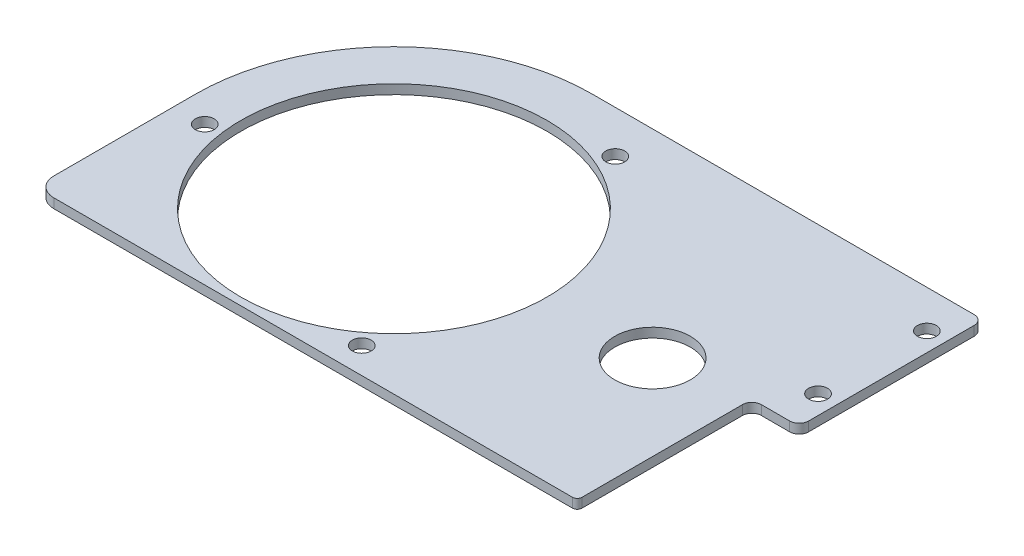
ISO-10303-21;
HEADER;
FILE_DESCRIPTION(('STEP AP214'),'2;1');
FILE_NAME('part.step','',(''),(''),'','','');
FILE_SCHEMA(('AUTOMOTIVE_DESIGN { 1 0 10303 214 1 1 1 1 }'));
ENDSEC;
DATA;
#1=APPLICATION_CONTEXT('core data for automotive mechanical design processes');
#2=APPLICATION_PROTOCOL_DEFINITION('international standard','automotive_design',2000,#1);
#3=PRODUCT_CONTEXT('',#1,'mechanical');
#4=PRODUCT('Part','Part','',(#3));
#5=PRODUCT_RELATED_PRODUCT_CATEGORY('part','',(#4));
#6=PRODUCT_DEFINITION_FORMATION('','',#4);
#7=PRODUCT_DEFINITION_CONTEXT('part definition',#1,'design');
#8=PRODUCT_DEFINITION('design','',#6,#7);
#9=PRODUCT_DEFINITION_SHAPE('','',#8);
#10=(LENGTH_UNIT() NAMED_UNIT(*) SI_UNIT(.MILLI.,.METRE.));
#11=(NAMED_UNIT(*) PLANE_ANGLE_UNIT() SI_UNIT($,.RADIAN.));
#12=(NAMED_UNIT(*) SI_UNIT($,.STERADIAN.) SOLID_ANGLE_UNIT());
#13=UNCERTAINTY_MEASURE_WITH_UNIT(LENGTH_MEASURE(1.E-05),#10,'distance_accuracy_value','');
#14=(GEOMETRIC_REPRESENTATION_CONTEXT(3) GLOBAL_UNCERTAINTY_ASSIGNED_CONTEXT((#13)) GLOBAL_UNIT_ASSIGNED_CONTEXT((#10,
#11,#12)) REPRESENTATION_CONTEXT('',''));
#15=CARTESIAN_POINT('',(0.,0.,0.));
#16=DIRECTION('',(0.,0.,1.));
#17=DIRECTION('',(1.,0.,0.));
#18=AXIS2_PLACEMENT_3D('',#15,#16,#17);
#19=CARTESIAN_POINT('',(-120.668920929197,6.35,95.2310790708027));
#20=DIRECTION('',(0.,-1.,0.));
#21=DIRECTION('',(0.,0.,-1.));
#22=AXIS2_PLACEMENT_3D('',#19,#20,#21);
#23=PLANE('',#22);
#24=CARTESIAN_POINT('',(-120.668920929197,6.35,95.2310790708027));
#25=DIRECTION('',(0.,1.,0.));
#26=DIRECTION('',(0.,0.,-1.));
#27=AXIS2_PLACEMENT_3D('',#24,#25,#26);
#28=CIRCLE('',#27,12.7);
#29=CARTESIAN_POINT('',(-133.368920929197,6.35,95.2310790708027));
#30=VERTEX_POINT('',#29);
#31=CARTESIAN_POINT('',(-120.668920929197,6.35,107.931079070803));
#32=VERTEX_POINT('',#31);
#33=EDGE_CURVE('E178',#30,#32,#28,.T.);
#34=ORIENTED_EDGE('',*,*,#33,.T.);
#35=DIRECTION('',(1.,0.,0.));
#36=VECTOR('',#35,1.);
#37=CARTESIAN_POINT('',(227.955539535401,6.35,107.931079070803));
#38=LINE('',#37,#36);
#39=CARTESIAN_POINT('',(227.955539535401,6.35,107.931079070803));
#40=VERTEX_POINT('',#39);
#41=EDGE_CURVE('E106',#32,#40,#38,.T.);
#42=ORIENTED_EDGE('',*,*,#41,.T.);
#43=CARTESIAN_POINT('',(227.955539535401,6.35,104.765539535401));
#44=DIRECTION('',(0.,1.,0.));
#45=DIRECTION('',(0.,0.,1.));
#46=AXIS2_PLACEMENT_3D('',#43,#44,#45);
#47=CIRCLE('',#46,3.16553953540139);
#48=CARTESIAN_POINT('',(231.121079070803,6.35,104.765539535401));
#49=VERTEX_POINT('',#48);
#50=EDGE_CURVE('E205',#40,#49,#47,.T.);
#51=ORIENTED_EDGE('',*,*,#50,.T.);
#52=DIRECTION('',(0.,0.,-1.));
#53=VECTOR('',#52,1.);
#54=CARTESIAN_POINT('',(231.121079070803,6.35,104.765539535401));
#55=LINE('',#54,#53);
#56=CARTESIAN_POINT('',(231.121079070803,6.35,-3.1007771089668));
#57=VERTEX_POINT('',#56);
#58=EDGE_CURVE('E224',#49,#57,#55,.T.);
#59=ORIENTED_EDGE('',*,*,#58,.T.);
#60=CARTESIAN_POINT('',(237.471079070803,6.35,-3.1007771089668));
#61=DIRECTION('',(0.,-1.,0.));
#62=DIRECTION('',(0.,0.,1.));
#63=AXIS2_PLACEMENT_3D('',#60,#61,#62);
#64=CIRCLE('',#63,6.35);
#65=CARTESIAN_POINT('',(237.471079070803,6.35,-9.4507771089668));
#66=VERTEX_POINT('',#65);
#67=EDGE_CURVE('E221',#57,#66,#64,.T.);
#68=ORIENTED_EDGE('',*,*,#67,.T.);
#69=DIRECTION('',(1.,0.,0.));
#70=VECTOR('',#69,1.);
#71=CARTESIAN_POINT('',(237.471079070803,6.35,-9.4507771089668));
#72=LINE('',#71,#70);
#73=CARTESIAN_POINT('',(256.521079070803,6.35,-9.4507771089668));
#74=VERTEX_POINT('',#73);
#75=EDGE_CURVE('E223',#66,#74,#72,.T.);
#76=ORIENTED_EDGE('',*,*,#75,.T.);
#77=CARTESIAN_POINT('',(256.521079070803,6.35,-15.8007771089668));
#78=DIRECTION('',(0.,1.,0.));
#79=DIRECTION('',(0.,0.,-1.));
#80=AXIS2_PLACEMENT_3D('',#77,#78,#79);
#81=CIRCLE('',#80,6.35000000000001);
#82=CARTESIAN_POINT('',(262.871079070803,6.35,-15.8007771089668));
#83=VERTEX_POINT('',#82);
#84=EDGE_CURVE('E226',#74,#83,#81,.T.);
#85=ORIENTED_EDGE('',*,*,#84,.T.);
#86=DIRECTION('',(0.,0.,-1.));
#87=VECTOR('',#86,1.);
#88=CARTESIAN_POINT('',(262.871079070803,6.35,-127.018920929198));
#89=LINE('',#88,#87);
#90=CARTESIAN_POINT('',(262.871079070803,6.35,-127.018920929198));
#91=VERTEX_POINT('',#90);
#92=EDGE_CURVE('E232',#83,#91,#89,.T.);
#93=ORIENTED_EDGE('',*,*,#92,.T.);
#94=CARTESIAN_POINT('',(256.521079070803,6.35,-127.018920929198));
#95=DIRECTION('',(0.,1.,0.));
#96=DIRECTION('',(0.,0.,-1.));
#97=AXIS2_PLACEMENT_3D('',#94,#95,#96);
#98=CIRCLE('',#97,6.34999999999997);
#99=CARTESIAN_POINT('',(256.521079070803,6.35,-133.368920929197));
#100=VERTEX_POINT('',#99);
#101=EDGE_CURVE('E137',#91,#100,#98,.T.);
#102=ORIENTED_EDGE('',*,*,#101,.T.);
#103=DIRECTION('',(-1.,0.,0.));
#104=VECTOR('',#103,1.);
#105=CARTESIAN_POINT('',(256.521079070803,6.35,-133.368920929197));
#106=LINE('',#105,#104);
#107=CARTESIAN_POINT('',(0.,6.35,-133.368920929197));
#108=VERTEX_POINT('',#107);
#109=EDGE_CURVE('E131',#100,#108,#106,.T.);
#110=ORIENTED_EDGE('',*,*,#109,.T.);
#111=CARTESIAN_POINT('',(0.,6.35,0.));
#112=DIRECTION('',(0.,1.,0.));
#113=DIRECTION('',(0.,0.,-1.));
#114=AXIS2_PLACEMENT_3D('',#111,#112,#113);
#115=CIRCLE('',#114,133.368920929197);
#116=CARTESIAN_POINT('',(-133.368920929197,6.35,0.));
#117=VERTEX_POINT('',#116);
#118=EDGE_CURVE('E135',#108,#117,#115,.T.);
#119=ORIENTED_EDGE('',*,*,#118,.T.);
#120=DIRECTION('',(0.,0.,1.));
#121=VECTOR('',#120,1.);
#122=CARTESIAN_POINT('',(-133.368920929197,6.35,0.));
#123=LINE('',#122,#121);
#124=EDGE_CURVE('E51',#117,#30,#123,.T.);
#125=ORIENTED_EDGE('',*,*,#124,.T.);
#126=EDGE_LOOP('',(#34,#42,#51,#59,#68,#76,#85,#93,#102,#110,#119,#125));
#127=FACE_BOUND('',#126,.T.);
#128=CARTESIAN_POINT('',(0.,6.35,0.));
#129=DIRECTION('',(0.,1.,0.));
#130=DIRECTION('',(0.,0.,1.));
#131=AXIS2_PLACEMENT_3D('',#128,#129,#130);
#132=CIRCLE('',#131,102.87);
#133=CARTESIAN_POINT('',(0.,6.35,102.87));
#134=VERTEX_POINT('',#133);
#135=EDGE_CURVE('E159',#134,#134,#132,.T.);
#136=ORIENTED_EDGE('',*,*,#135,.F.);
#137=EDGE_LOOP('',(#136));
#138=FACE_BOUND('',#137,.T.);
#139=CARTESIAN_POINT('',(-112.738641363337,6.35,14.3749635436912));
#140=DIRECTION('',(0.,1.,0.));
#141=DIRECTION('',(0.,0.,1.));
#142=AXIS2_PLACEMENT_3D('',#139,#140,#141);
#143=CIRCLE('',#142,6.34999999998862);
#144=CARTESIAN_POINT('',(-112.738641363337,6.35,20.7249635436798));
#145=VERTEX_POINT('',#144);
#146=EDGE_CURVE('E326',#145,#145,#143,.T.);
#147=ORIENTED_EDGE('',*,*,#146,.F.);
#148=EDGE_LOOP('',(#147));
#149=FACE_BOUND('',#148,.T.);
#150=CARTESIAN_POINT('',(250.171079070803,6.35,-107.968920929197));
#151=DIRECTION('',(0.,1.,0.));
#152=DIRECTION('',(0.,0.,1.));
#153=AXIS2_PLACEMENT_3D('',#150,#151,#152);
#154=CIRCLE('',#153,6.34999999999999);
#155=CARTESIAN_POINT('',(250.171079070803,6.35,-101.618920929198));
#156=VERTEX_POINT('',#155);
#157=EDGE_CURVE('E320',#156,#156,#154,.T.);
#158=ORIENTED_EDGE('',*,*,#157,.F.);
#159=EDGE_LOOP('',(#158));
#160=FACE_BOUND('',#159,.T.);
#161=CARTESIAN_POINT('',(250.171079070803,6.35,-34.8507771089668));
#162=DIRECTION('',(0.,1.,0.));
#163=DIRECTION('',(0.,0.,1.));
#164=AXIS2_PLACEMENT_3D('',#161,#162,#163);
#165=CIRCLE('',#164,6.34999999999993);
#166=CARTESIAN_POINT('',(250.171079070803,6.35,-28.5007771089669));
#167=VERTEX_POINT('',#166);
#168=EDGE_CURVE('E314',#167,#167,#165,.T.);
#169=ORIENTED_EDGE('',*,*,#168,.F.);
#170=EDGE_LOOP('',(#169));
#171=FACE_BOUND('',#170,.T.);
#172=CARTESIAN_POINT('',(43.9202370743566,6.35,-104.822009180638));
#173=DIRECTION('',(0.,1.,0.));
#174=DIRECTION('',(0.,0.,1.));
#175=AXIS2_PLACEMENT_3D('',#172,#173,#174);
#176=CIRCLE('',#175,6.35000000000598);
#177=CARTESIAN_POINT('',(43.9202370743566,6.35,-98.4720091806325));
#178=VERTEX_POINT('',#177);
#179=EDGE_CURVE('E308',#178,#178,#176,.T.);
#180=ORIENTED_EDGE('',*,*,#179,.F.);
#181=EDGE_LOOP('',(#180));
#182=FACE_BOUND('',#181,.T.);
#183=CARTESIAN_POINT('',(68.8184042889803,6.35,90.4470456369472));
#184=DIRECTION('',(0.,1.,0.));
#185=DIRECTION('',(0.,0.,1.));
#186=AXIS2_PLACEMENT_3D('',#183,#184,#185);
#187=CIRCLE('',#186,6.35000000000536);
#188=CARTESIAN_POINT('',(68.8184042889803,6.35,96.7970456369525));
#189=VERTEX_POINT('',#188);
#190=EDGE_CURVE('E301',#189,#189,#187,.T.);
#191=ORIENTED_EDGE('',*,*,#190,.F.);
#192=EDGE_LOOP('',(#191));
#193=FACE_BOUND('',#192,.T.);
#194=CARTESIAN_POINT('',(173.810939205606,6.35,0.));
#195=DIRECTION('',(0.,-1.,0.));
#196=DIRECTION('',(0.,0.,-1.));
#197=AXIS2_PLACEMENT_3D('',#194,#195,#196);
#198=CIRCLE('',#197,25.4);
#199=CARTESIAN_POINT('',(173.810939205606,6.35,-25.4));
#200=VERTEX_POINT('',#199);
#201=EDGE_CURVE('E296',#200,#200,#198,.F.);
#202=ORIENTED_EDGE('',*,*,#201,.F.);
#203=EDGE_LOOP('',(#202));
#204=FACE_BOUND('',#203,.T.);
#205=ADVANCED_FACE('F34',(#127,#138,#149,#160,#171,#182,#193,#204),#23,.F.);
#206=CARTESIAN_POINT('',(-120.668920929197,0.,95.2310790708027));
#207=DIRECTION('',(0.,-1.,0.));
#208=DIRECTION('',(0.,0.,-1.));
#209=AXIS2_PLACEMENT_3D('',#206,#207,#208);
#210=PLANE('',#209);
#211=CARTESIAN_POINT('',(68.8184042889803,0.,90.4470456369472));
#212=DIRECTION('',(0.,1.,0.));
#213=DIRECTION('',(0.,0.,1.));
#214=AXIS2_PLACEMENT_3D('',#211,#212,#213);
#215=CIRCLE('',#214,6.35000000000536);
#216=CARTESIAN_POINT('',(68.8184042889803,0.,96.7970456369525));
#217=VERTEX_POINT('',#216);
#218=EDGE_CURVE('E298',#217,#217,#215,.T.);
#219=ORIENTED_EDGE('',*,*,#218,.T.);
#220=EDGE_LOOP('',(#219));
#221=FACE_BOUND('',#220,.T.);
#222=CARTESIAN_POINT('',(250.171079070803,0.,-34.8507771089668));
#223=DIRECTION('',(0.,1.,0.));
#224=DIRECTION('',(0.,0.,1.));
#225=AXIS2_PLACEMENT_3D('',#222,#223,#224);
#226=CIRCLE('',#225,6.34999999999993);
#227=CARTESIAN_POINT('',(250.171079070803,0.,-28.5007771089669));
#228=VERTEX_POINT('',#227);
#229=EDGE_CURVE('E311',#228,#228,#226,.T.);
#230=ORIENTED_EDGE('',*,*,#229,.T.);
#231=EDGE_LOOP('',(#230));
#232=FACE_BOUND('',#231,.T.);
#233=CARTESIAN_POINT('',(-112.738641363337,0.,14.3749635436912));
#234=DIRECTION('',(0.,1.,0.));
#235=DIRECTION('',(0.,0.,1.));
#236=AXIS2_PLACEMENT_3D('',#233,#234,#235);
#237=CIRCLE('',#236,6.34999999998862);
#238=CARTESIAN_POINT('',(-112.738641363337,0.,20.7249635436798));
#239=VERTEX_POINT('',#238);
#240=EDGE_CURVE('E323',#239,#239,#237,.T.);
#241=ORIENTED_EDGE('',*,*,#240,.T.);
#242=EDGE_LOOP('',(#241));
#243=FACE_BOUND('',#242,.T.);
#244=CARTESIAN_POINT('',(-120.668920929197,0.,95.2310790708027));
#245=DIRECTION('',(0.,1.,0.));
#246=DIRECTION('',(0.,0.,-1.));
#247=AXIS2_PLACEMENT_3D('',#244,#245,#246);
#248=CIRCLE('',#247,12.7);
#249=CARTESIAN_POINT('',(-133.368920929197,0.,95.2310790708027));
#250=VERTEX_POINT('',#249);
#251=CARTESIAN_POINT('',(-120.668920929197,0.,107.931079070803));
#252=VERTEX_POINT('',#251);
#253=EDGE_CURVE('E155',#250,#252,#248,.T.);
#254=ORIENTED_EDGE('',*,*,#253,.F.);
#255=DIRECTION('',(0.,0.,1.));
#256=VECTOR('',#255,1.);
#257=CARTESIAN_POINT('',(-133.368920929197,0.,0.));
#258=LINE('',#257,#256);
#259=CARTESIAN_POINT('',(-133.368920929197,0.,0.));
#260=VERTEX_POINT('',#259);
#261=EDGE_CURVE('E98',#260,#250,#258,.T.);
#262=ORIENTED_EDGE('',*,*,#261,.F.);
#263=CARTESIAN_POINT('',(0.,0.,0.));
#264=DIRECTION('',(0.,1.,0.));
#265=DIRECTION('',(0.,0.,-1.));
#266=AXIS2_PLACEMENT_3D('',#263,#264,#265);
#267=CIRCLE('',#266,133.368920929197);
#268=CARTESIAN_POINT('',(0.,0.,-133.368920929197));
#269=VERTEX_POINT('',#268);
#270=EDGE_CURVE('E92',#269,#260,#267,.T.);
#271=ORIENTED_EDGE('',*,*,#270,.F.);
#272=DIRECTION('',(-1.,0.,0.));
#273=VECTOR('',#272,1.);
#274=CARTESIAN_POINT('',(256.521079070803,0.,-133.368920929197));
#275=LINE('',#274,#273);
#276=CARTESIAN_POINT('',(256.521079070803,0.,-133.368920929197));
#277=VERTEX_POINT('',#276);
#278=EDGE_CURVE('E145',#277,#269,#275,.T.);
#279=ORIENTED_EDGE('',*,*,#278,.F.);
#280=CARTESIAN_POINT('',(256.521079070803,0.,-127.018920929198));
#281=DIRECTION('',(0.,1.,0.));
#282=DIRECTION('',(0.,0.,-1.));
#283=AXIS2_PLACEMENT_3D('',#280,#281,#282);
#284=CIRCLE('',#283,6.34999999999997);
#285=CARTESIAN_POINT('',(262.871079070803,0.,-127.018920929198));
#286=VERTEX_POINT('',#285);
#287=EDGE_CURVE('E173',#286,#277,#284,.T.);
#288=ORIENTED_EDGE('',*,*,#287,.F.);
#289=DIRECTION('',(0.,0.,-1.));
#290=VECTOR('',#289,1.);
#291=CARTESIAN_POINT('',(262.871079070803,0.,-127.018920929198));
#292=LINE('',#291,#290);
#293=CARTESIAN_POINT('',(262.871079070803,0.,-15.8007771089668));
#294=VERTEX_POINT('',#293);
#295=EDGE_CURVE('E171',#294,#286,#292,.T.);
#296=ORIENTED_EDGE('',*,*,#295,.F.);
#297=CARTESIAN_POINT('',(256.521079070803,0.,-15.8007771089668));
#298=DIRECTION('',(0.,1.,0.));
#299=DIRECTION('',(0.,0.,-1.));
#300=AXIS2_PLACEMENT_3D('',#297,#298,#299);
#301=CIRCLE('',#300,6.35000000000001);
#302=CARTESIAN_POINT('',(256.521079070803,0.,-9.4507771089668));
#303=VERTEX_POINT('',#302);
#304=EDGE_CURVE('E169',#303,#294,#301,.T.);
#305=ORIENTED_EDGE('',*,*,#304,.F.);
#306=DIRECTION('',(1.,0.,0.));
#307=VECTOR('',#306,1.);
#308=CARTESIAN_POINT('',(237.471079070803,0.,-9.4507771089668));
#309=LINE('',#308,#307);
#310=CARTESIAN_POINT('',(237.471079070803,0.,-9.4507771089668));
#311=VERTEX_POINT('',#310);
#312=EDGE_CURVE('E167',#311,#303,#309,.T.);
#313=ORIENTED_EDGE('',*,*,#312,.F.);
#314=CARTESIAN_POINT('',(237.471079070803,0.,-3.1007771089668));
#315=DIRECTION('',(0.,-1.,0.));
#316=DIRECTION('',(0.,0.,1.));
#317=AXIS2_PLACEMENT_3D('',#314,#315,#316);
#318=CIRCLE('',#317,6.35);
#319=CARTESIAN_POINT('',(231.121079070803,0.,-3.1007771089668));
#320=VERTEX_POINT('',#319);
#321=EDGE_CURVE('E165',#320,#311,#318,.T.);
#322=ORIENTED_EDGE('',*,*,#321,.F.);
#323=DIRECTION('',(0.,0.,-1.));
#324=VECTOR('',#323,1.);
#325=CARTESIAN_POINT('',(231.121079070803,0.,104.765539535401));
#326=LINE('',#325,#324);
#327=CARTESIAN_POINT('',(231.121079070803,0.,104.765539535401));
#328=VERTEX_POINT('',#327);
#329=EDGE_CURVE('E163',#328,#320,#326,.T.);
#330=ORIENTED_EDGE('',*,*,#329,.F.);
#331=CARTESIAN_POINT('',(227.955539535401,0.,104.765539535401));
#332=DIRECTION('',(0.,1.,0.));
#333=DIRECTION('',(0.,0.,1.));
#334=AXIS2_PLACEMENT_3D('',#331,#332,#333);
#335=CIRCLE('',#334,3.16553953540139);
#336=CARTESIAN_POINT('',(227.955539535401,0.,107.931079070803));
#337=VERTEX_POINT('',#336);
#338=EDGE_CURVE('E161',#337,#328,#335,.T.);
#339=ORIENTED_EDGE('',*,*,#338,.F.);
#340=DIRECTION('',(1.,0.,0.));
#341=VECTOR('',#340,1.);
#342=CARTESIAN_POINT('',(227.955539535401,0.,107.931079070803));
#343=LINE('',#342,#341);
#344=EDGE_CURVE('E158',#252,#337,#343,.T.);
#345=ORIENTED_EDGE('',*,*,#344,.F.);
#346=EDGE_LOOP('',(#254,#262,#271,#279,#288,#296,#305,#313,#322,#330,#339,#345));
#347=FACE_BOUND('',#346,.T.);
#348=CARTESIAN_POINT('',(0.,0.,0.));
#349=DIRECTION('',(0.,1.,0.));
#350=DIRECTION('',(0.,0.,1.));
#351=AXIS2_PLACEMENT_3D('',#348,#349,#350);
#352=CIRCLE('',#351,102.87);
#353=CARTESIAN_POINT('',(0.,0.,102.87));
#354=VERTEX_POINT('',#353);
#355=EDGE_CURVE('E329',#354,#354,#352,.T.);
#356=ORIENTED_EDGE('',*,*,#355,.T.);
#357=EDGE_LOOP('',(#356));
#358=FACE_BOUND('',#357,.T.);
#359=CARTESIAN_POINT('',(250.171079070803,0.,-107.968920929197));
#360=DIRECTION('',(0.,1.,0.));
#361=DIRECTION('',(0.,0.,1.));
#362=AXIS2_PLACEMENT_3D('',#359,#360,#361);
#363=CIRCLE('',#362,6.34999999999999);
#364=CARTESIAN_POINT('',(250.171079070803,0.,-101.618920929198));
#365=VERTEX_POINT('',#364);
#366=EDGE_CURVE('E317',#365,#365,#363,.T.);
#367=ORIENTED_EDGE('',*,*,#366,.T.);
#368=EDGE_LOOP('',(#367));
#369=FACE_BOUND('',#368,.T.);
#370=CARTESIAN_POINT('',(43.9202370743566,0.,-104.822009180638));
#371=DIRECTION('',(0.,1.,0.));
#372=DIRECTION('',(0.,0.,1.));
#373=AXIS2_PLACEMENT_3D('',#370,#371,#372);
#374=CIRCLE('',#373,6.35000000000598);
#375=CARTESIAN_POINT('',(43.9202370743566,0.,-98.4720091806325));
#376=VERTEX_POINT('',#375);
#377=EDGE_CURVE('E306',#376,#376,#374,.T.);
#378=ORIENTED_EDGE('',*,*,#377,.T.);
#379=EDGE_LOOP('',(#378));
#380=FACE_BOUND('',#379,.T.);
#381=CARTESIAN_POINT('',(173.810939205606,0.,0.));
#382=DIRECTION('',(0.,1.,0.));
#383=DIRECTION('',(0.,0.,1.));
#384=AXIS2_PLACEMENT_3D('',#381,#382,#383);
#385=CIRCLE('',#384,25.4);
#386=CARTESIAN_POINT('',(173.810939205606,0.,25.4));
#387=VERTEX_POINT('',#386);
#388=EDGE_CURVE('E293',#387,#387,#385,.T.);
#389=ORIENTED_EDGE('',*,*,#388,.T.);
#390=EDGE_LOOP('',(#389));
#391=FACE_BOUND('',#390,.T.);
#392=ADVANCED_FACE('F209',(#221,#232,#243,#347,#358,#369,#380,#391),#210,.T.);
#393=CARTESIAN_POINT('',(-120.668920929197,6.35,95.2310790708027));
#394=DIRECTION('',(0.,-1.,0.));
#395=DIRECTION('',(0.,0.,-1.));
#396=AXIS2_PLACEMENT_3D('',#393,#394,#395);
#397=CYLINDRICAL_SURFACE('',#396,12.7);
#398=ORIENTED_EDGE('',*,*,#253,.T.);
#399=DIRECTION('',(0.,-1.,0.));
#400=VECTOR('',#399,1.);
#401=CARTESIAN_POINT('',(-120.668920929197,6.35,107.931079070803));
#402=LINE('',#401,#400);
#403=EDGE_CURVE('E11',#32,#252,#402,.T.);
#404=ORIENTED_EDGE('',*,*,#403,.F.);
#405=ORIENTED_EDGE('',*,*,#33,.F.);
#406=DIRECTION('',(0.,-1.,0.));
#407=VECTOR('',#406,1.);
#408=CARTESIAN_POINT('',(-133.368920929197,6.35,95.2310790708027));
#409=LINE('',#408,#407);
#410=EDGE_CURVE('E151',#30,#250,#409,.T.);
#411=ORIENTED_EDGE('',*,*,#410,.T.);
#412=EDGE_LOOP('',(#398,#404,#405,#411));
#413=FACE_BOUND('',#412,.T.);
#414=ADVANCED_FACE('F36',(#413),#397,.T.);
#415=CARTESIAN_POINT('',(227.955539535401,6.35,107.931079070803));
#416=DIRECTION('',(0.,0.,-1.));
#417=DIRECTION('',(-1.,0.,0.));
#418=AXIS2_PLACEMENT_3D('',#415,#416,#417);
#419=PLANE('',#418);
#420=ORIENTED_EDGE('',*,*,#344,.T.);
#421=DIRECTION('',(0.,-1.,0.));
#422=VECTOR('',#421,1.);
#423=CARTESIAN_POINT('',(227.955539535401,6.35,107.931079070803));
#424=LINE('',#423,#422);
#425=EDGE_CURVE('E43',#40,#337,#424,.T.);
#426=ORIENTED_EDGE('',*,*,#425,.F.);
#427=ORIENTED_EDGE('',*,*,#41,.F.);
#428=ORIENTED_EDGE('',*,*,#403,.T.);
#429=EDGE_LOOP('',(#420,#426,#427,#428));
#430=FACE_BOUND('',#429,.T.);
#431=ADVANCED_FACE('F470',(#430),#419,.F.);
#432=CARTESIAN_POINT('',(227.955539535401,6.35,104.765539535401));
#433=DIRECTION('',(0.,-1.,0.));
#434=DIRECTION('',(0.,0.,-1.));
#435=AXIS2_PLACEMENT_3D('',#432,#433,#434);
#436=CYLINDRICAL_SURFACE('',#435,3.16553953540139);
#437=ORIENTED_EDGE('',*,*,#338,.T.);
#438=DIRECTION('',(0.,-1.,0.));
#439=VECTOR('',#438,1.);
#440=CARTESIAN_POINT('',(231.121079070803,6.35,104.765539535401));
#441=LINE('',#440,#439);
#442=EDGE_CURVE('E197',#49,#328,#441,.T.);
#443=ORIENTED_EDGE('',*,*,#442,.F.);
#444=ORIENTED_EDGE('',*,*,#50,.F.);
#445=ORIENTED_EDGE('',*,*,#425,.T.);
#446=EDGE_LOOP('',(#437,#443,#444,#445));
#447=FACE_BOUND('',#446,.T.);
#448=ADVANCED_FACE('F203',(#447),#436,.T.);
#449=CARTESIAN_POINT('',(231.121079070803,6.35,104.765539535401));
#450=DIRECTION('',(-1.,0.,0.));
#451=DIRECTION('',(0.,0.,1.));
#452=AXIS2_PLACEMENT_3D('',#449,#450,#451);
#453=PLANE('',#452);
#454=ORIENTED_EDGE('',*,*,#329,.T.);
#455=DIRECTION('',(0.,-1.,0.));
#456=VECTOR('',#455,1.);
#457=CARTESIAN_POINT('',(231.121079070803,6.35,-3.1007771089668));
#458=LINE('',#457,#456);
#459=EDGE_CURVE('E194',#57,#320,#458,.T.);
#460=ORIENTED_EDGE('',*,*,#459,.F.);
#461=ORIENTED_EDGE('',*,*,#58,.F.);
#462=ORIENTED_EDGE('',*,*,#442,.T.);
#463=EDGE_LOOP('',(#454,#460,#461,#462));
#464=FACE_BOUND('',#463,.T.);
#465=ADVANCED_FACE('F215',(#464),#453,.F.);
#466=CARTESIAN_POINT('',(237.471079070803,6.35,-3.1007771089668));
#467=DIRECTION('',(0.,-1.,0.));
#468=DIRECTION('',(0.,0.,-1.));
#469=AXIS2_PLACEMENT_3D('',#466,#467,#468);
#470=CYLINDRICAL_SURFACE('',#469,6.35);
#471=ORIENTED_EDGE('',*,*,#321,.T.);
#472=DIRECTION('',(0.,-1.,0.));
#473=VECTOR('',#472,1.);
#474=CARTESIAN_POINT('',(237.471079070803,6.35,-9.4507771089668));
#475=LINE('',#474,#473);
#476=EDGE_CURVE('E191',#66,#311,#475,.T.);
#477=ORIENTED_EDGE('',*,*,#476,.F.);
#478=ORIENTED_EDGE('',*,*,#67,.F.);
#479=ORIENTED_EDGE('',*,*,#459,.T.);
#480=EDGE_LOOP('',(#471,#477,#478,#479));
#481=FACE_BOUND('',#480,.T.);
#482=ADVANCED_FACE('F219',(#481),#470,.F.);
#483=CARTESIAN_POINT('',(237.471079070803,6.35,-9.4507771089668));
#484=DIRECTION('',(0.,0.,-1.));
#485=DIRECTION('',(-1.,0.,0.));
#486=AXIS2_PLACEMENT_3D('',#483,#484,#485);
#487=PLANE('',#486);
#488=ORIENTED_EDGE('',*,*,#312,.T.);
#489=DIRECTION('',(0.,-1.,0.));
#490=VECTOR('',#489,1.);
#491=CARTESIAN_POINT('',(256.521079070803,6.35,-9.4507771089668));
#492=LINE('',#491,#490);
#493=EDGE_CURVE('E188',#74,#303,#492,.T.);
#494=ORIENTED_EDGE('',*,*,#493,.F.);
#495=ORIENTED_EDGE('',*,*,#75,.F.);
#496=ORIENTED_EDGE('',*,*,#476,.T.);
#497=EDGE_LOOP('',(#488,#494,#495,#496));
#498=FACE_BOUND('',#497,.T.);
#499=ADVANCED_FACE('F435',(#498),#487,.F.);
#500=CARTESIAN_POINT('',(256.521079070803,6.35,-15.8007771089668));
#501=DIRECTION('',(0.,-1.,0.));
#502=DIRECTION('',(0.,0.,-1.));
#503=AXIS2_PLACEMENT_3D('',#500,#501,#502);
#504=CYLINDRICAL_SURFACE('',#503,6.35000000000001);
#505=ORIENTED_EDGE('',*,*,#304,.T.);
#506=DIRECTION('',(0.,-1.,0.));
#507=VECTOR('',#506,1.);
#508=CARTESIAN_POINT('',(262.871079070803,6.35,-15.8007771089668));
#509=LINE('',#508,#507);
#510=EDGE_CURVE('E185',#83,#294,#509,.T.);
#511=ORIENTED_EDGE('',*,*,#510,.F.);
#512=ORIENTED_EDGE('',*,*,#84,.F.);
#513=ORIENTED_EDGE('',*,*,#493,.T.);
#514=EDGE_LOOP('',(#505,#511,#512,#513));
#515=FACE_BOUND('',#514,.T.);
#516=ADVANCED_FACE('F426',(#515),#504,.T.);
#517=CARTESIAN_POINT('',(262.871079070803,6.35,-127.018920929198));
#518=DIRECTION('',(-1.,0.,0.));
#519=DIRECTION('',(0.,0.,1.));
#520=AXIS2_PLACEMENT_3D('',#517,#518,#519);
#521=PLANE('',#520);
#522=ORIENTED_EDGE('',*,*,#295,.T.);
#523=DIRECTION('',(0.,-1.,0.));
#524=VECTOR('',#523,1.);
#525=CARTESIAN_POINT('',(262.871079070803,6.35,-127.018920929198));
#526=LINE('',#525,#524);
#527=EDGE_CURVE('E182',#91,#286,#526,.T.);
#528=ORIENTED_EDGE('',*,*,#527,.F.);
#529=ORIENTED_EDGE('',*,*,#92,.F.);
#530=ORIENTED_EDGE('',*,*,#510,.T.);
#531=EDGE_LOOP('',(#522,#528,#529,#530));
#532=FACE_BOUND('',#531,.T.);
#533=ADVANCED_FACE('F238',(#532),#521,.F.);
#534=CARTESIAN_POINT('',(256.521079070803,6.35,-127.018920929198));
#535=DIRECTION('',(0.,-1.,0.));
#536=DIRECTION('',(0.,0.,-1.));
#537=AXIS2_PLACEMENT_3D('',#534,#535,#536);
#538=CYLINDRICAL_SURFACE('',#537,6.34999999999997);
#539=ORIENTED_EDGE('',*,*,#287,.T.);
#540=DIRECTION('',(0.,-1.,0.));
#541=VECTOR('',#540,1.);
#542=CARTESIAN_POINT('',(256.521079070803,6.35,-133.368920929197));
#543=LINE('',#542,#541);
#544=EDGE_CURVE('E146',#100,#277,#543,.T.);
#545=ORIENTED_EDGE('',*,*,#544,.F.);
#546=ORIENTED_EDGE('',*,*,#101,.F.);
#547=ORIENTED_EDGE('',*,*,#527,.T.);
#548=EDGE_LOOP('',(#539,#545,#546,#547));
#549=FACE_BOUND('',#548,.T.);
#550=ADVANCED_FACE('F242',(#549),#538,.T.);
#551=CARTESIAN_POINT('',(256.521079070803,6.35,-133.368920929197));
#552=DIRECTION('',(0.,0.,1.));
#553=DIRECTION('',(1.,0.,0.));
#554=AXIS2_PLACEMENT_3D('',#551,#552,#553);
#555=PLANE('',#554);
#556=ORIENTED_EDGE('',*,*,#278,.T.);
#557=DIRECTION('',(0.,-1.,0.));
#558=VECTOR('',#557,1.);
#559=CARTESIAN_POINT('',(0.,6.35,-133.368920929197));
#560=LINE('',#559,#558);
#561=EDGE_CURVE('E142',#108,#269,#560,.T.);
#562=ORIENTED_EDGE('',*,*,#561,.F.);
#563=ORIENTED_EDGE('',*,*,#109,.F.);
#564=ORIENTED_EDGE('',*,*,#544,.T.);
#565=EDGE_LOOP('',(#556,#562,#563,#564));
#566=FACE_BOUND('',#565,.T.);
#567=ADVANCED_FACE('F143',(#566),#555,.F.);
#568=CARTESIAN_POINT('',(0.,6.35,0.));
#569=DIRECTION('',(0.,-1.,0.));
#570=DIRECTION('',(0.,0.,-1.));
#571=AXIS2_PLACEMENT_3D('',#568,#569,#570);
#572=CYLINDRICAL_SURFACE('',#571,133.368920929197);
#573=ORIENTED_EDGE('',*,*,#270,.T.);
#574=DIRECTION('',(0.,-1.,0.));
#575=VECTOR('',#574,1.);
#576=CARTESIAN_POINT('',(-133.368920929197,6.35,0.));
#577=LINE('',#576,#575);
#578=EDGE_CURVE('E147',#117,#260,#577,.T.);
#579=ORIENTED_EDGE('',*,*,#578,.F.);
#580=ORIENTED_EDGE('',*,*,#118,.F.);
#581=ORIENTED_EDGE('',*,*,#561,.T.);
#582=EDGE_LOOP('',(#573,#579,#580,#581));
#583=FACE_BOUND('',#582,.T.);
#584=ADVANCED_FACE('F149',(#583),#572,.T.);
#585=CARTESIAN_POINT('',(-133.368920929197,6.35,0.));
#586=DIRECTION('',(1.,0.,0.));
#587=DIRECTION('',(0.,0.,-1.));
#588=AXIS2_PLACEMENT_3D('',#585,#586,#587);
#589=PLANE('',#588);
#590=ORIENTED_EDGE('',*,*,#261,.T.);
#591=ORIENTED_EDGE('',*,*,#410,.F.);
#592=ORIENTED_EDGE('',*,*,#124,.F.);
#593=ORIENTED_EDGE('',*,*,#578,.T.);
#594=EDGE_LOOP('',(#590,#591,#592,#593));
#595=FACE_BOUND('',#594,.T.);
#596=ADVANCED_FACE('F246',(#595),#589,.F.);
#597=CARTESIAN_POINT('',(0.,6.35,0.));
#598=DIRECTION('',(0.,-1.,0.));
#599=DIRECTION('',(0.,0.,-1.));
#600=AXIS2_PLACEMENT_3D('',#597,#598,#599);
#601=CYLINDRICAL_SURFACE('',#600,102.87);
#602=ORIENTED_EDGE('',*,*,#135,.T.);
#603=EDGE_LOOP('',(#602));
#604=FACE_BOUND('',#603,.T.);
#605=ORIENTED_EDGE('',*,*,#355,.F.);
#606=EDGE_LOOP('',(#605));
#607=FACE_BOUND('',#606,.T.);
#608=ADVANCED_FACE('F248',(#604,#607),#601,.F.);
#609=CARTESIAN_POINT('',(-112.738641363337,6.35,14.3749635436912));
#610=DIRECTION('',(0.,-1.,0.));
#611=DIRECTION('',(0.,0.,-1.));
#612=AXIS2_PLACEMENT_3D('',#609,#610,#611);
#613=CYLINDRICAL_SURFACE('',#612,6.34999999998862);
#614=ORIENTED_EDGE('',*,*,#146,.T.);
#615=EDGE_LOOP('',(#614));
#616=FACE_BOUND('',#615,.T.);
#617=ORIENTED_EDGE('',*,*,#240,.F.);
#618=EDGE_LOOP('',(#617));
#619=FACE_BOUND('',#618,.T.);
#620=ADVANCED_FACE('F254',(#616,#619),#613,.F.);
#621=CARTESIAN_POINT('',(250.171079070803,6.35,-107.968920929197));
#622=DIRECTION('',(0.,-1.,0.));
#623=DIRECTION('',(0.,0.,-1.));
#624=AXIS2_PLACEMENT_3D('',#621,#622,#623);
#625=CYLINDRICAL_SURFACE('',#624,6.34999999999999);
#626=ORIENTED_EDGE('',*,*,#157,.T.);
#627=EDGE_LOOP('',(#626));
#628=FACE_BOUND('',#627,.T.);
#629=ORIENTED_EDGE('',*,*,#366,.F.);
#630=EDGE_LOOP('',(#629));
#631=FACE_BOUND('',#630,.T.);
#632=ADVANCED_FACE('F268',(#628,#631),#625,.F.);
#633=CARTESIAN_POINT('',(250.171079070803,6.35,-34.8507771089668));
#634=DIRECTION('',(0.,-1.,0.));
#635=DIRECTION('',(0.,0.,-1.));
#636=AXIS2_PLACEMENT_3D('',#633,#634,#635);
#637=CYLINDRICAL_SURFACE('',#636,6.34999999999993);
#638=ORIENTED_EDGE('',*,*,#168,.T.);
#639=EDGE_LOOP('',(#638));
#640=FACE_BOUND('',#639,.T.);
#641=ORIENTED_EDGE('',*,*,#229,.F.);
#642=EDGE_LOOP('',(#641));
#643=FACE_BOUND('',#642,.T.);
#644=ADVANCED_FACE('F272',(#640,#643),#637,.F.);
#645=CARTESIAN_POINT('',(43.9202370743566,6.35,-104.822009180638));
#646=DIRECTION('',(0.,-1.,0.));
#647=DIRECTION('',(0.,0.,-1.));
#648=AXIS2_PLACEMENT_3D('',#645,#646,#647);
#649=CYLINDRICAL_SURFACE('',#648,6.35000000000598);
#650=ORIENTED_EDGE('',*,*,#179,.T.);
#651=EDGE_LOOP('',(#650));
#652=FACE_BOUND('',#651,.T.);
#653=ORIENTED_EDGE('',*,*,#377,.F.);
#654=EDGE_LOOP('',(#653));
#655=FACE_BOUND('',#654,.T.);
#656=ADVANCED_FACE('F276',(#652,#655),#649,.F.);
#657=CARTESIAN_POINT('',(68.8184042889803,6.35,90.4470456369472));
#658=DIRECTION('',(0.,-1.,0.));
#659=DIRECTION('',(0.,0.,-1.));
#660=AXIS2_PLACEMENT_3D('',#657,#658,#659);
#661=CYLINDRICAL_SURFACE('',#660,6.35000000000536);
#662=ORIENTED_EDGE('',*,*,#190,.T.);
#663=EDGE_LOOP('',(#662));
#664=FACE_BOUND('',#663,.T.);
#665=ORIENTED_EDGE('',*,*,#218,.F.);
#666=EDGE_LOOP('',(#665));
#667=FACE_BOUND('',#666,.T.);
#668=ADVANCED_FACE('F280',(#664,#667),#661,.F.);
#669=CARTESIAN_POINT('',(173.810939205606,28.448,0.));
#670=DIRECTION('',(0.,-1.,0.));
#671=DIRECTION('',(0.,0.,-1.));
#672=AXIS2_PLACEMENT_3D('',#669,#670,#671);
#673=CYLINDRICAL_SURFACE('',#672,25.4);
#674=ORIENTED_EDGE('',*,*,#388,.F.);
#675=EDGE_LOOP('',(#674));
#676=FACE_BOUND('',#675,.T.);
#677=ORIENTED_EDGE('',*,*,#201,.T.);
#678=EDGE_LOOP('',(#677));
#679=FACE_BOUND('',#678,.T.);
#680=ADVANCED_FACE('F284',(#676,#679),#673,.F.);
#681=CLOSED_SHELL('',(#205,#392,#414,#431,#448,#465,#482,#499,#516,#533,#550,#567,#584,#596,
#608,#620,#632,#644,#656,#668,#680));
#682=MANIFOLD_SOLID_BREP('B2',#681);
#683=ADVANCED_BREP_SHAPE_REPRESENTATION('',(#18,#682),#14);
#684=SHAPE_DEFINITION_REPRESENTATION(#9,#683);
ENDSEC;
END-ISO-10303-21;
